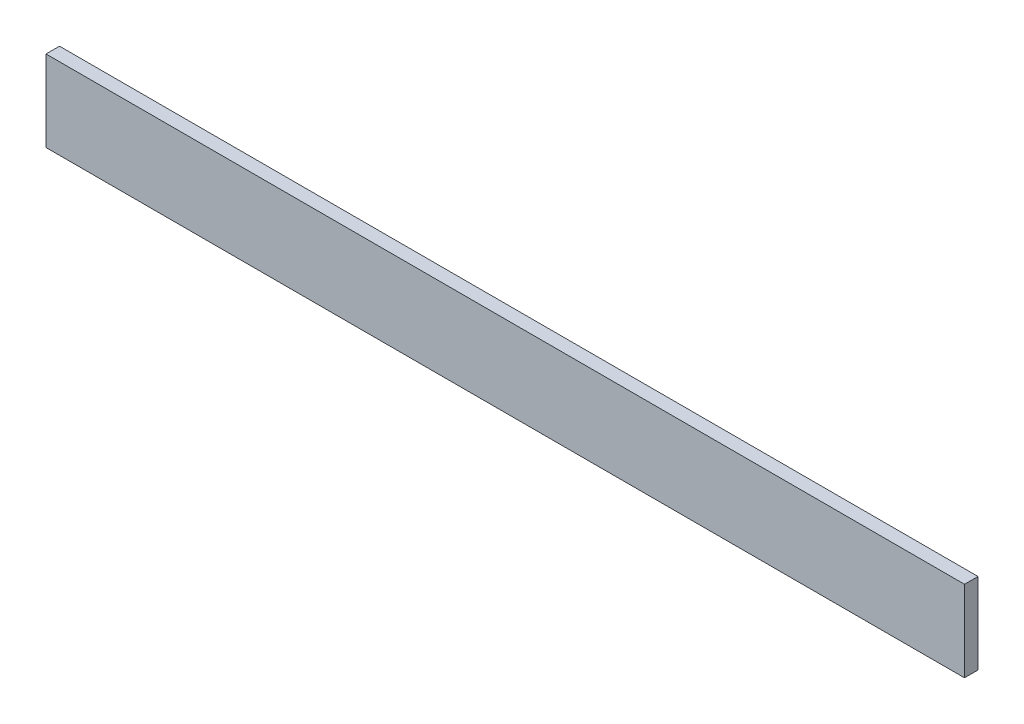
ISO-10303-21;
HEADER;
FILE_DESCRIPTION(('STEP AP214'),'2;1');
FILE_NAME('part.step','',(''),(''),'','','');
FILE_SCHEMA(('AUTOMOTIVE_DESIGN { 1 0 10303 214 1 1 1 1 }'));
ENDSEC;
DATA;
#1=APPLICATION_CONTEXT('core data for automotive mechanical design processes');
#2=APPLICATION_PROTOCOL_DEFINITION('international standard','automotive_design',2000,#1);
#3=PRODUCT_CONTEXT('',#1,'mechanical');
#4=PRODUCT('Part','Part','',(#3));
#5=PRODUCT_RELATED_PRODUCT_CATEGORY('part','',(#4));
#6=PRODUCT_DEFINITION_FORMATION('','',#4);
#7=PRODUCT_DEFINITION_CONTEXT('part definition',#1,'design');
#8=PRODUCT_DEFINITION('design','',#6,#7);
#9=PRODUCT_DEFINITION_SHAPE('','',#8);
#10=(LENGTH_UNIT() NAMED_UNIT(*) SI_UNIT(.MILLI.,.METRE.));
#11=(NAMED_UNIT(*) PLANE_ANGLE_UNIT() SI_UNIT($,.RADIAN.));
#12=(NAMED_UNIT(*) SI_UNIT($,.STERADIAN.) SOLID_ANGLE_UNIT());
#13=UNCERTAINTY_MEASURE_WITH_UNIT(LENGTH_MEASURE(1.E-05),#10,'distance_accuracy_value','');
#14=(GEOMETRIC_REPRESENTATION_CONTEXT(3) GLOBAL_UNCERTAINTY_ASSIGNED_CONTEXT((#13)) GLOBAL_UNIT_ASSIGNED_CONTEXT((#10,
#11,#12)) REPRESENTATION_CONTEXT('',''));
#15=CARTESIAN_POINT('',(0.,0.,0.));
#16=DIRECTION('',(0.,0.,1.));
#17=DIRECTION('',(1.,0.,0.));
#18=AXIS2_PLACEMENT_3D('',#15,#16,#17);
#19=CARTESIAN_POINT('',(-101.806504065041,43.5895663956639,3.175));
#20=DIRECTION('',(1.,0.,0.));
#21=DIRECTION('',(0.,1.,0.));
#22=AXIS2_PLACEMENT_3D('',#19,#20,#21);
#23=PLANE('',#22);
#24=DIRECTION('',(0.,-1.,0.));
#25=VECTOR('',#24,1.);
#26=CARTESIAN_POINT('',(-101.806504065041,43.5895663956639,0.));
#27=LINE('',#26,#25);
#28=CARTESIAN_POINT('',(-101.806504065041,43.5895663956639,0.));
#29=VERTEX_POINT('',#28);
#30=CARTESIAN_POINT('',(-101.806504065041,24.5395663956639,0.));
#31=VERTEX_POINT('',#30);
#32=EDGE_CURVE('E96',#29,#31,#27,.T.);
#33=ORIENTED_EDGE('',*,*,#32,.T.);
#34=DIRECTION('',(0.,0.,-1.));
#35=VECTOR('',#34,1.);
#36=CARTESIAN_POINT('',(-101.806504065041,24.5395663956639,3.175));
#37=LINE('',#36,#35);
#38=CARTESIAN_POINT('',(-101.806504065041,24.5395663956639,3.175));
#39=VERTEX_POINT('',#38);
#40=EDGE_CURVE('E11',#39,#31,#37,.T.);
#41=ORIENTED_EDGE('',*,*,#40,.F.);
#42=DIRECTION('',(0.,-1.,0.));
#43=VECTOR('',#42,1.);
#44=CARTESIAN_POINT('',(-101.806504065041,43.5895663956639,3.175));
#45=LINE('',#44,#43);
#46=CARTESIAN_POINT('',(-101.806504065041,43.5895663956639,3.175));
#47=VERTEX_POINT('',#46);
#48=EDGE_CURVE('E84',#47,#39,#45,.T.);
#49=ORIENTED_EDGE('',*,*,#48,.F.);
#50=DIRECTION('',(0.,0.,-1.));
#51=VECTOR('',#50,1.);
#52=CARTESIAN_POINT('',(-101.806504065041,43.5895663956639,3.175));
#53=LINE('',#52,#51);
#54=EDGE_CURVE('E92',#47,#29,#53,.T.);
#55=ORIENTED_EDGE('',*,*,#54,.T.);
#56=EDGE_LOOP('',(#33,#41,#49,#55));
#57=FACE_BOUND('',#56,.T.);
#58=ADVANCED_FACE('F33',(#57),#23,.F.);
#59=CARTESIAN_POINT('',(-101.806504065041,24.5395663956639,3.175));
#60=DIRECTION('',(0.,1.,0.));
#61=DIRECTION('',(0.,0.,1.));
#62=AXIS2_PLACEMENT_3D('',#59,#60,#61);
#63=PLANE('',#62);
#64=DIRECTION('',(1.,0.,0.));
#65=VECTOR('',#64,1.);
#66=CARTESIAN_POINT('',(-101.806504065041,24.5395663956639,0.));
#67=LINE('',#66,#65);
#68=CARTESIAN_POINT('',(114.093495934959,24.5395663956639,0.));
#69=VERTEX_POINT('',#68);
#70=EDGE_CURVE('E88',#31,#69,#67,.T.);
#71=ORIENTED_EDGE('',*,*,#70,.T.);
#72=DIRECTION('',(0.,0.,-1.));
#73=VECTOR('',#72,1.);
#74=CARTESIAN_POINT('',(114.093495934959,24.5395663956639,3.175));
#75=LINE('',#74,#73);
#76=CARTESIAN_POINT('',(114.093495934959,24.5395663956639,3.175));
#77=VERTEX_POINT('',#76);
#78=EDGE_CURVE('E41',#77,#69,#75,.T.);
#79=ORIENTED_EDGE('',*,*,#78,.F.);
#80=DIRECTION('',(1.,0.,0.));
#81=VECTOR('',#80,1.);
#82=CARTESIAN_POINT('',(-101.806504065041,24.5395663956639,3.175));
#83=LINE('',#82,#81);
#84=EDGE_CURVE('E79',#39,#77,#83,.T.);
#85=ORIENTED_EDGE('',*,*,#84,.F.);
#86=ORIENTED_EDGE('',*,*,#40,.T.);
#87=EDGE_LOOP('',(#71,#79,#85,#86));
#88=FACE_BOUND('',#87,.T.);
#89=ADVANCED_FACE('F87',(#88),#63,.F.);
#90=CARTESIAN_POINT('',(114.093495934959,43.5895663956639,3.175));
#91=DIRECTION('',(-1.,0.,0.));
#92=DIRECTION('',(0.,-1.,0.));
#93=AXIS2_PLACEMENT_3D('',#90,#91,#92);
#94=PLANE('',#93);
#95=DIRECTION('',(0.,1.,0.));
#96=VECTOR('',#95,1.);
#97=CARTESIAN_POINT('',(114.093495934959,43.5895663956639,0.));
#98=LINE('',#97,#96);
#99=CARTESIAN_POINT('',(114.093495934959,43.5895663956639,0.));
#100=VERTEX_POINT('',#99);
#101=EDGE_CURVE('E66',#69,#100,#98,.T.);
#102=ORIENTED_EDGE('',*,*,#101,.T.);
#103=DIRECTION('',(0.,0.,-1.));
#104=VECTOR('',#103,1.);
#105=CARTESIAN_POINT('',(114.093495934959,43.5895663956639,3.175));
#106=LINE('',#105,#104);
#107=CARTESIAN_POINT('',(114.093495934959,43.5895663956639,3.175));
#108=VERTEX_POINT('',#107);
#109=EDGE_CURVE('E89',#108,#100,#106,.T.);
#110=ORIENTED_EDGE('',*,*,#109,.F.);
#111=DIRECTION('',(0.,1.,0.));
#112=VECTOR('',#111,1.);
#113=CARTESIAN_POINT('',(114.093495934959,43.5895663956639,3.175));
#114=LINE('',#113,#112);
#115=EDGE_CURVE('E82',#77,#108,#114,.T.);
#116=ORIENTED_EDGE('',*,*,#115,.F.);
#117=ORIENTED_EDGE('',*,*,#78,.T.);
#118=EDGE_LOOP('',(#102,#110,#116,#117));
#119=FACE_BOUND('',#118,.T.);
#120=ADVANCED_FACE('F90',(#119),#94,.F.);
#121=CARTESIAN_POINT('',(-101.806504065041,43.5895663956639,3.175));
#122=DIRECTION('',(0.,-1.,0.));
#123=DIRECTION('',(0.,0.,-1.));
#124=AXIS2_PLACEMENT_3D('',#121,#122,#123);
#125=PLANE('',#124);
#126=DIRECTION('',(-1.,0.,0.));
#127=VECTOR('',#126,1.);
#128=CARTESIAN_POINT('',(-101.806504065041,43.5895663956639,0.));
#129=LINE('',#128,#127);
#130=EDGE_CURVE('E72',#100,#29,#129,.T.);
#131=ORIENTED_EDGE('',*,*,#130,.T.);
#132=ORIENTED_EDGE('',*,*,#54,.F.);
#133=DIRECTION('',(-1.,0.,0.));
#134=VECTOR('',#133,1.);
#135=CARTESIAN_POINT('',(-101.806504065041,43.5895663956639,3.175));
#136=LINE('',#135,#134);
#137=EDGE_CURVE('E49',#108,#47,#136,.T.);
#138=ORIENTED_EDGE('',*,*,#137,.F.);
#139=ORIENTED_EDGE('',*,*,#109,.T.);
#140=EDGE_LOOP('',(#131,#132,#138,#139));
#141=FACE_BOUND('',#140,.T.);
#142=ADVANCED_FACE('F103',(#141),#125,.F.);
#143=CARTESIAN_POINT('',(0.,0.,3.175));
#144=DIRECTION('',(0.,0.,1.));
#145=DIRECTION('',(1.,0.,0.));
#146=AXIS2_PLACEMENT_3D('',#143,#144,#145);
#147=PLANE('',#146);
#148=ORIENTED_EDGE('',*,*,#48,.T.);
#149=ORIENTED_EDGE('',*,*,#84,.T.);
#150=ORIENTED_EDGE('',*,*,#115,.T.);
#151=ORIENTED_EDGE('',*,*,#137,.T.);
#152=EDGE_LOOP('',(#148,#149,#150,#151));
#153=FACE_BOUND('',#152,.T.);
#154=ADVANCED_FACE('F80',(#153),#147,.T.);
#155=CARTESIAN_POINT('',(0.,0.,0.));
#156=DIRECTION('',(0.,0.,1.));
#157=DIRECTION('',(1.,0.,0.));
#158=AXIS2_PLACEMENT_3D('',#155,#156,#157);
#159=PLANE('',#158);
#160=ORIENTED_EDGE('',*,*,#32,.F.);
#161=ORIENTED_EDGE('',*,*,#130,.F.);
#162=ORIENTED_EDGE('',*,*,#101,.F.);
#163=ORIENTED_EDGE('',*,*,#70,.F.);
#164=EDGE_LOOP('',(#160,#161,#162,#163));
#165=FACE_BOUND('',#164,.T.);
#166=ADVANCED_FACE('F106',(#165),#159,.F.);
#167=CLOSED_SHELL('',(#58,#89,#120,#142,#154,#166));
#168=MANIFOLD_SOLID_BREP('B2',#167);
#169=ADVANCED_BREP_SHAPE_REPRESENTATION('',(#18,#168),#14);
#170=SHAPE_DEFINITION_REPRESENTATION(#9,#169);
ENDSEC;
END-ISO-10303-21;
